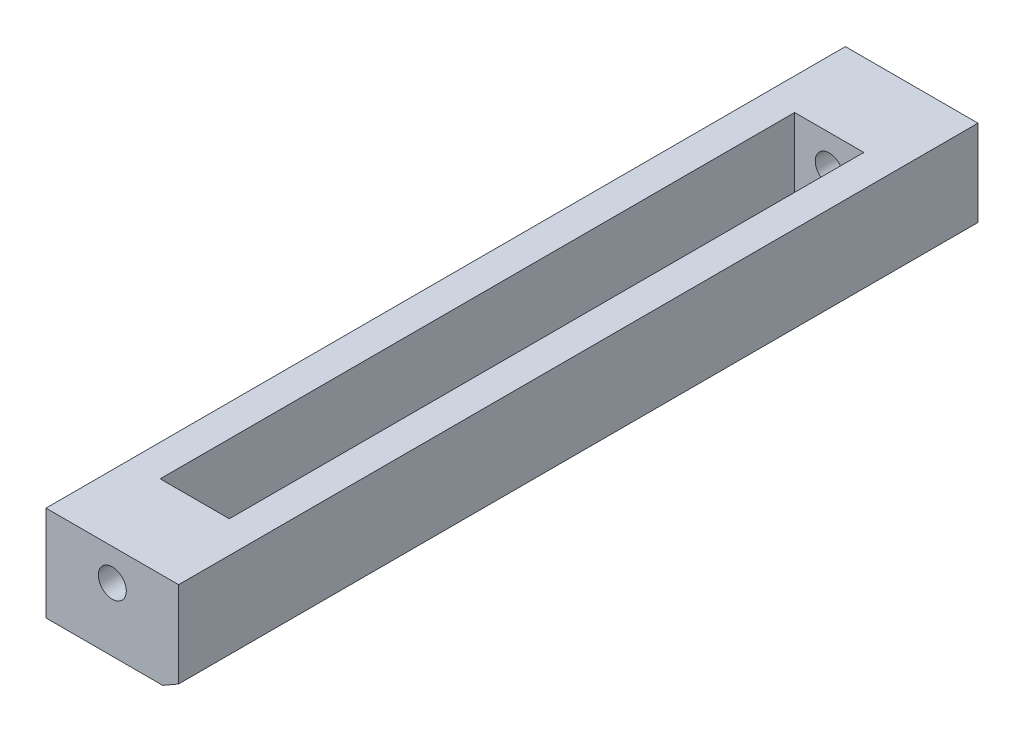
ISO-10303-21;
HEADER;
FILE_DESCRIPTION(('STEP AP214'),'2;1');
FILE_NAME('part.step','',(''),(''),'','','');
FILE_SCHEMA(('AUTOMOTIVE_DESIGN { 1 0 10303 214 1 1 1 1 }'));
ENDSEC;
DATA;
#1=APPLICATION_CONTEXT('core data for automotive mechanical design processes');
#2=APPLICATION_PROTOCOL_DEFINITION('international standard','automotive_design',2000,#1);
#3=PRODUCT_CONTEXT('',#1,'mechanical');
#4=PRODUCT('Part','Part','',(#3));
#5=PRODUCT_RELATED_PRODUCT_CATEGORY('part','',(#4));
#6=PRODUCT_DEFINITION_FORMATION('','',#4);
#7=PRODUCT_DEFINITION_CONTEXT('part definition',#1,'design');
#8=PRODUCT_DEFINITION('design','',#6,#7);
#9=PRODUCT_DEFINITION_SHAPE('','',#8);
#10=(LENGTH_UNIT() NAMED_UNIT(*) SI_UNIT(.MILLI.,.METRE.));
#11=(NAMED_UNIT(*) PLANE_ANGLE_UNIT() SI_UNIT($,.RADIAN.));
#12=(NAMED_UNIT(*) SI_UNIT($,.STERADIAN.) SOLID_ANGLE_UNIT());
#13=UNCERTAINTY_MEASURE_WITH_UNIT(LENGTH_MEASURE(1.E-05),#10,'distance_accuracy_value','');
#14=(GEOMETRIC_REPRESENTATION_CONTEXT(3) GLOBAL_UNCERTAINTY_ASSIGNED_CONTEXT((#13)) GLOBAL_UNIT_ASSIGNED_CONTEXT((#10,
#11,#12)) REPRESENTATION_CONTEXT('',''));
#15=CARTESIAN_POINT('',(0.,0.,0.));
#16=DIRECTION('',(0.,0.,1.));
#17=DIRECTION('',(1.,0.,0.));
#18=AXIS2_PLACEMENT_3D('',#15,#16,#17);
#19=CARTESIAN_POINT('',(6.63575,-6.35,40.00000001));
#20=DIRECTION('',(1.,0.,0.));
#21=DIRECTION('',(0.,0.,-1.));
#22=AXIS2_PLACEMENT_3D('',#19,#20,#21);
#23=PLANE('',#22);
#24=DIRECTION('',(0.,1.,0.));
#25=VECTOR('',#24,1.);
#26=CARTESIAN_POINT('',(6.63575,-6.35,40.00000001));
#27=LINE('',#26,#25);
#28=CARTESIAN_POINT('',(6.63575,-5.43345644766147,40.00000001));
#29=VERTEX_POINT('',#28);
#30=CARTESIAN_POINT('',(6.63575,3.175,40.00000001));
#31=VERTEX_POINT('',#30);
#32=EDGE_CURVE('E174',#29,#31,#27,.T.);
#33=ORIENTED_EDGE('',*,*,#32,.F.);
#34=DIRECTION('',(0.,0.,-1.));
#35=VECTOR('',#34,1.);
#36=CARTESIAN_POINT('',(6.63575,-5.43345644766147,40.00000001));
#37=LINE('',#36,#35);
#38=CARTESIAN_POINT('',(6.63575,-5.43345644766147,-40.00000001));
#39=VERTEX_POINT('',#38);
#40=EDGE_CURVE('E176',#29,#39,#37,.T.);
#41=ORIENTED_EDGE('',*,*,#40,.T.);
#42=DIRECTION('',(0.,1.,0.));
#43=VECTOR('',#42,1.);
#44=CARTESIAN_POINT('',(6.63575,-6.35,-40.00000001));
#45=LINE('',#44,#43);
#46=CARTESIAN_POINT('',(6.63575,3.175,-40.00000001));
#47=VERTEX_POINT('',#46);
#48=EDGE_CURVE('E173',#39,#47,#45,.T.);
#49=ORIENTED_EDGE('',*,*,#48,.T.);
#50=DIRECTION('',(0.,0.,-1.));
#51=VECTOR('',#50,1.);
#52=CARTESIAN_POINT('',(6.63575,3.175,40.00000001));
#53=LINE('',#52,#51);
#54=EDGE_CURVE('E142',#31,#47,#53,.T.);
#55=ORIENTED_EDGE('',*,*,#54,.F.);
#56=EDGE_LOOP('',(#33,#41,#49,#55));
#57=FACE_BOUND('',#56,.T.);
#58=ADVANCED_FACE('F38',(#57),#23,.T.);
#59=CARTESIAN_POINT('',(-6.63575,-6.35,40.00000001));
#60=DIRECTION('',(0.,0.,1.));
#61=DIRECTION('',(1.,0.,0.));
#62=AXIS2_PLACEMENT_3D('',#59,#60,#61);
#63=PLANE('',#62);
#64=CARTESIAN_POINT('',(0.,0.,40.00000001));
#65=DIRECTION('',(0.,0.,1.));
#66=DIRECTION('',(1.,0.,0.));
#67=AXIS2_PLACEMENT_3D('',#64,#65,#66);
#68=CIRCLE('',#67,1.399999994);
#69=CARTESIAN_POINT('',(1.399999994,0.,40.00000001));
#70=VERTEX_POINT('',#69);
#71=EDGE_CURVE('E252',#70,#70,#68,.T.);
#72=ORIENTED_EDGE('',*,*,#71,.F.);
#73=EDGE_LOOP('',(#72));
#74=FACE_BOUND('',#73,.T.);
#75=DIRECTION('',(1.,0.,0.));
#76=VECTOR('',#75,1.);
#77=CARTESIAN_POINT('',(-6.63575,-6.35,40.00000001));
#78=LINE('',#77,#76);
#79=CARTESIAN_POINT('',(-6.63575,-6.35,40.00000001));
#80=VERTEX_POINT('',#79);
#81=CARTESIAN_POINT('',(5.04825,-6.35,40.00000001));
#82=VERTEX_POINT('',#81);
#83=EDGE_CURVE('E171',#80,#82,#78,.T.);
#84=ORIENTED_EDGE('',*,*,#83,.T.);
#85=DIRECTION('',(-0.86602540378444,-0.499999999999998,0.));
#86=VECTOR('',#85,1.);
#87=CARTESIAN_POINT('',(-3.71475000000003,-11.4093204089087,40.00000001));
#88=LINE('',#87,#86);
#89=EDGE_CURVE('E11',#82,#29,#88,.F.);
#90=ORIENTED_EDGE('',*,*,#89,.T.);
#91=ORIENTED_EDGE('',*,*,#32,.T.);
#92=DIRECTION('',(1.,0.,0.));
#93=VECTOR('',#92,1.);
#94=CARTESIAN_POINT('',(-6.63575,3.175,40.00000001));
#95=LINE('',#94,#93);
#96=CARTESIAN_POINT('',(-6.63575,3.175,40.00000001));
#97=VERTEX_POINT('',#96);
#98=EDGE_CURVE('E151',#97,#31,#95,.T.);
#99=ORIENTED_EDGE('',*,*,#98,.F.);
#100=DIRECTION('',(0.,1.,0.));
#101=VECTOR('',#100,1.);
#102=CARTESIAN_POINT('',(-6.63575,-6.35,40.00000001));
#103=LINE('',#102,#101);
#104=EDGE_CURVE('E177',#80,#97,#103,.T.);
#105=ORIENTED_EDGE('',*,*,#104,.F.);
#106=EDGE_LOOP('',(#84,#90,#91,#99,#105));
#107=FACE_BOUND('',#106,.T.);
#108=ADVANCED_FACE('F201',(#74,#107),#63,.T.);
#109=CARTESIAN_POINT('',(-6.63575,-6.35,40.00000001));
#110=DIRECTION('',(-1.,0.,0.));
#111=DIRECTION('',(0.,0.,1.));
#112=AXIS2_PLACEMENT_3D('',#109,#110,#111);
#113=PLANE('',#112);
#114=ORIENTED_EDGE('',*,*,#104,.T.);
#115=DIRECTION('',(0.,0.,1.));
#116=VECTOR('',#115,1.);
#117=CARTESIAN_POINT('',(-6.63575,3.175,40.00000001));
#118=LINE('',#117,#116);
#119=CARTESIAN_POINT('',(-6.63575,3.175,-40.00000001));
#120=VERTEX_POINT('',#119);
#121=EDGE_CURVE('E148',#120,#97,#118,.T.);
#122=ORIENTED_EDGE('',*,*,#121,.F.);
#123=DIRECTION('',(0.,1.,0.));
#124=VECTOR('',#123,1.);
#125=CARTESIAN_POINT('',(-6.63575,-6.35,-40.00000001));
#126=LINE('',#125,#124);
#127=CARTESIAN_POINT('',(-6.63575,-6.35,-40.00000001));
#128=VERTEX_POINT('',#127);
#129=EDGE_CURVE('E179',#128,#120,#126,.T.);
#130=ORIENTED_EDGE('',*,*,#129,.F.);
#131=DIRECTION('',(0.,0.,1.));
#132=VECTOR('',#131,1.);
#133=CARTESIAN_POINT('',(-6.63575,-6.35,40.00000001));
#134=LINE('',#133,#132);
#135=EDGE_CURVE('E168',#128,#80,#134,.T.);
#136=ORIENTED_EDGE('',*,*,#135,.T.);
#137=EDGE_LOOP('',(#114,#122,#130,#136));
#138=FACE_BOUND('',#137,.T.);
#139=ADVANCED_FACE('F214',(#138),#113,.T.);
#140=CARTESIAN_POINT('',(-6.63575,-6.35,-40.00000001));
#141=DIRECTION('',(0.,0.,-1.));
#142=DIRECTION('',(-1.,0.,0.));
#143=AXIS2_PLACEMENT_3D('',#140,#141,#142);
#144=PLANE('',#143);
#145=CARTESIAN_POINT('',(0.,0.,-40.00000001));
#146=DIRECTION('',(0.,0.,1.));
#147=DIRECTION('',(1.,0.,0.));
#148=AXIS2_PLACEMENT_3D('',#145,#146,#147);
#149=CIRCLE('',#148,1.399999994);
#150=CARTESIAN_POINT('',(1.399999994,0.,-40.00000001));
#151=VERTEX_POINT('',#150);
#152=EDGE_CURVE('E185',#151,#151,#149,.T.);
#153=ORIENTED_EDGE('',*,*,#152,.T.);
#154=EDGE_LOOP('',(#153));
#155=FACE_BOUND('',#154,.T.);
#156=ORIENTED_EDGE('',*,*,#48,.F.);
#157=DIRECTION('',(0.86602540378444,0.499999999999998,0.));
#158=VECTOR('',#157,1.);
#159=CARTESIAN_POINT('',(-3.71475000000003,-11.4093204089087,-40.00000001));
#160=LINE('',#159,#158);
#161=CARTESIAN_POINT('',(5.04825,-6.35,-40.00000001));
#162=VERTEX_POINT('',#161);
#163=EDGE_CURVE('E61',#39,#162,#160,.F.);
#164=ORIENTED_EDGE('',*,*,#163,.T.);
#165=DIRECTION('',(-1.,0.,0.));
#166=VECTOR('',#165,1.);
#167=CARTESIAN_POINT('',(-6.63575,-6.35,-40.00000001));
#168=LINE('',#167,#166);
#169=EDGE_CURVE('E163',#162,#128,#168,.T.);
#170=ORIENTED_EDGE('',*,*,#169,.T.);
#171=ORIENTED_EDGE('',*,*,#129,.T.);
#172=DIRECTION('',(-1.,0.,0.));
#173=VECTOR('',#172,1.);
#174=CARTESIAN_POINT('',(-6.63575,3.175,-40.00000001));
#175=LINE('',#174,#173);
#176=EDGE_CURVE('E145',#47,#120,#175,.T.);
#177=ORIENTED_EDGE('',*,*,#176,.F.);
#178=EDGE_LOOP('',(#156,#164,#170,#171,#177));
#179=FACE_BOUND('',#178,.T.);
#180=ADVANCED_FACE('F195',(#155,#179),#144,.T.);
#181=CARTESIAN_POINT('',(0.,-6.35,0.));
#182=DIRECTION('',(0.,-1.,0.));
#183=DIRECTION('',(0.,0.,-1.));
#184=AXIS2_PLACEMENT_3D('',#181,#182,#183);
#185=PLANE('',#184);
#186=DIRECTION('',(0.,0.,-1.));
#187=VECTOR('',#186,1.);
#188=CARTESIAN_POINT('',(3.46075,-6.35,31.75));
#189=LINE('',#188,#187);
#190=CARTESIAN_POINT('',(3.46075,-6.35,31.75));
#191=VERTEX_POINT('',#190);
#192=CARTESIAN_POINT('',(3.46075,-6.35,-31.75));
#193=VERTEX_POINT('',#192);
#194=EDGE_CURVE('E154',#191,#193,#189,.T.);
#195=ORIENTED_EDGE('',*,*,#194,.T.);
#196=DIRECTION('',(-1.,0.,0.));
#197=VECTOR('',#196,1.);
#198=CARTESIAN_POINT('',(-3.46075,-6.35,-31.75));
#199=LINE('',#198,#197);
#200=CARTESIAN_POINT('',(-3.46075,-6.35,-31.75));
#201=VERTEX_POINT('',#200);
#202=EDGE_CURVE('E117',#193,#201,#199,.T.);
#203=ORIENTED_EDGE('',*,*,#202,.T.);
#204=DIRECTION('',(0.,0.,1.));
#205=VECTOR('',#204,1.);
#206=CARTESIAN_POINT('',(-3.46075,-6.35,31.75));
#207=LINE('',#206,#205);
#208=CARTESIAN_POINT('',(-3.46075,-6.35,31.75));
#209=VERTEX_POINT('',#208);
#210=EDGE_CURVE('E157',#201,#209,#207,.T.);
#211=ORIENTED_EDGE('',*,*,#210,.T.);
#212=DIRECTION('',(1.,0.,0.));
#213=VECTOR('',#212,1.);
#214=CARTESIAN_POINT('',(-3.46075,-6.35,31.75));
#215=LINE('',#214,#213);
#216=EDGE_CURVE('E122',#209,#191,#215,.T.);
#217=ORIENTED_EDGE('',*,*,#216,.T.);
#218=EDGE_LOOP('',(#195,#203,#211,#217));
#219=FACE_BOUND('',#218,.T.);
#220=ORIENTED_EDGE('',*,*,#169,.F.);
#221=DIRECTION('',(0.,0.,1.));
#222=VECTOR('',#221,1.);
#223=CARTESIAN_POINT('',(5.04825,-6.35,0.));
#224=LINE('',#223,#222);
#225=EDGE_CURVE('E47',#162,#82,#224,.T.);
#226=ORIENTED_EDGE('',*,*,#225,.T.);
#227=ORIENTED_EDGE('',*,*,#83,.F.);
#228=ORIENTED_EDGE('',*,*,#135,.F.);
#229=EDGE_LOOP('',(#220,#226,#227,#228));
#230=FACE_BOUND('',#229,.T.);
#231=ADVANCED_FACE('F220',(#219,#230),#185,.T.);
#232=CARTESIAN_POINT('',(3.46075,-6.35,31.75));
#233=DIRECTION('',(1.,0.,0.));
#234=DIRECTION('',(0.,0.,-1.));
#235=AXIS2_PLACEMENT_3D('',#232,#233,#234);
#236=PLANE('',#235);
#237=DIRECTION('',(0.,1.,0.));
#238=VECTOR('',#237,1.);
#239=CARTESIAN_POINT('',(3.46075,-6.35,31.75));
#240=LINE('',#239,#238);
#241=CARTESIAN_POINT('',(3.46075,3.175,31.75));
#242=VERTEX_POINT('',#241);
#243=EDGE_CURVE('E127',#191,#242,#240,.T.);
#244=ORIENTED_EDGE('',*,*,#243,.T.);
#245=DIRECTION('',(0.,0.,-1.));
#246=VECTOR('',#245,1.);
#247=CARTESIAN_POINT('',(3.46075,3.175,31.75));
#248=LINE('',#247,#246);
#249=CARTESIAN_POINT('',(3.46075,3.175,-31.75));
#250=VERTEX_POINT('',#249);
#251=EDGE_CURVE('E125',#242,#250,#248,.T.);
#252=ORIENTED_EDGE('',*,*,#251,.T.);
#253=DIRECTION('',(0.,1.,0.));
#254=VECTOR('',#253,1.);
#255=CARTESIAN_POINT('',(3.46075,-6.35,-31.75));
#256=LINE('',#255,#254);
#257=EDGE_CURVE('E109',#193,#250,#256,.T.);
#258=ORIENTED_EDGE('',*,*,#257,.F.);
#259=ORIENTED_EDGE('',*,*,#194,.F.);
#260=EDGE_LOOP('',(#244,#252,#258,#259));
#261=FACE_BOUND('',#260,.T.);
#262=ADVANCED_FACE('F126',(#261),#236,.F.);
#263=CARTESIAN_POINT('',(-3.46075,-6.35,31.75));
#264=DIRECTION('',(0.,0.,1.));
#265=DIRECTION('',(1.,0.,0.));
#266=AXIS2_PLACEMENT_3D('',#263,#264,#265);
#267=PLANE('',#266);
#268=CARTESIAN_POINT('',(0.,0.,31.75));
#269=DIRECTION('',(0.,0.,1.));
#270=DIRECTION('',(1.,0.,0.));
#271=AXIS2_PLACEMENT_3D('',#268,#269,#270);
#272=CIRCLE('',#271,1.399999994);
#273=CARTESIAN_POINT('',(1.399999994,0.,31.75));
#274=VERTEX_POINT('',#273);
#275=EDGE_CURVE('E131',#274,#274,#272,.T.);
#276=ORIENTED_EDGE('',*,*,#275,.T.);
#277=EDGE_LOOP('',(#276));
#278=FACE_BOUND('',#277,.T.);
#279=DIRECTION('',(0.,1.,0.));
#280=VECTOR('',#279,1.);
#281=CARTESIAN_POINT('',(-3.46075,-6.35,31.75));
#282=LINE('',#281,#280);
#283=CARTESIAN_POINT('',(-3.46075,3.175,31.75));
#284=VERTEX_POINT('',#283);
#285=EDGE_CURVE('E164',#209,#284,#282,.T.);
#286=ORIENTED_EDGE('',*,*,#285,.T.);
#287=DIRECTION('',(1.,0.,0.));
#288=VECTOR('',#287,1.);
#289=CARTESIAN_POINT('',(-3.46075,3.175,31.75));
#290=LINE('',#289,#288);
#291=EDGE_CURVE('E137',#284,#242,#290,.T.);
#292=ORIENTED_EDGE('',*,*,#291,.T.);
#293=ORIENTED_EDGE('',*,*,#243,.F.);
#294=ORIENTED_EDGE('',*,*,#216,.F.);
#295=EDGE_LOOP('',(#286,#292,#293,#294));
#296=FACE_BOUND('',#295,.T.);
#297=ADVANCED_FACE('F230',(#278,#296),#267,.F.);
#298=CARTESIAN_POINT('',(-3.46075,-6.35,31.75));
#299=DIRECTION('',(-1.,0.,0.));
#300=DIRECTION('',(0.,0.,1.));
#301=AXIS2_PLACEMENT_3D('',#298,#299,#300);
#302=PLANE('',#301);
#303=DIRECTION('',(0.,1.,0.));
#304=VECTOR('',#303,1.);
#305=CARTESIAN_POINT('',(-3.46075,-6.35,-31.75));
#306=LINE('',#305,#304);
#307=CARTESIAN_POINT('',(-3.46075,3.175,-31.75));
#308=VERTEX_POINT('',#307);
#309=EDGE_CURVE('E121',#201,#308,#306,.T.);
#310=ORIENTED_EDGE('',*,*,#309,.T.);
#311=DIRECTION('',(0.,0.,1.));
#312=VECTOR('',#311,1.);
#313=CARTESIAN_POINT('',(-3.46075,3.175,31.75));
#314=LINE('',#313,#312);
#315=EDGE_CURVE('E135',#308,#284,#314,.T.);
#316=ORIENTED_EDGE('',*,*,#315,.T.);
#317=ORIENTED_EDGE('',*,*,#285,.F.);
#318=ORIENTED_EDGE('',*,*,#210,.F.);
#319=EDGE_LOOP('',(#310,#316,#317,#318));
#320=FACE_BOUND('',#319,.T.);
#321=ADVANCED_FACE('F233',(#320),#302,.F.);
#322=CARTESIAN_POINT('',(-3.46075,-6.35,-31.75));
#323=DIRECTION('',(0.,0.,-1.));
#324=DIRECTION('',(-1.,0.,0.));
#325=AXIS2_PLACEMENT_3D('',#322,#323,#324);
#326=PLANE('',#325);
#327=CARTESIAN_POINT('',(0.,0.,-31.75));
#328=DIRECTION('',(0.,0.,-1.));
#329=DIRECTION('',(-1.,0.,0.));
#330=AXIS2_PLACEMENT_3D('',#327,#328,#329);
#331=CIRCLE('',#330,1.399999994);
#332=CARTESIAN_POINT('',(-1.399999994,0.,-31.75));
#333=VERTEX_POINT('',#332);
#334=EDGE_CURVE('E182',#333,#333,#331,.T.);
#335=ORIENTED_EDGE('',*,*,#334,.T.);
#336=EDGE_LOOP('',(#335));
#337=FACE_BOUND('',#336,.T.);
#338=ORIENTED_EDGE('',*,*,#257,.T.);
#339=DIRECTION('',(-1.,0.,0.));
#340=VECTOR('',#339,1.);
#341=CARTESIAN_POINT('',(-3.46075,3.175,-31.75));
#342=LINE('',#341,#340);
#343=EDGE_CURVE('E114',#250,#308,#342,.T.);
#344=ORIENTED_EDGE('',*,*,#343,.T.);
#345=ORIENTED_EDGE('',*,*,#309,.F.);
#346=ORIENTED_EDGE('',*,*,#202,.F.);
#347=EDGE_LOOP('',(#338,#344,#345,#346));
#348=FACE_BOUND('',#347,.T.);
#349=ADVANCED_FACE('F111',(#337,#348),#326,.F.);
#350=CARTESIAN_POINT('',(0.,3.175,0.));
#351=DIRECTION('',(0.,-1.,0.));
#352=DIRECTION('',(0.,0.,-1.));
#353=AXIS2_PLACEMENT_3D('',#350,#351,#352);
#354=PLANE('',#353);
#355=ORIENTED_EDGE('',*,*,#54,.T.);
#356=ORIENTED_EDGE('',*,*,#176,.T.);
#357=ORIENTED_EDGE('',*,*,#121,.T.);
#358=ORIENTED_EDGE('',*,*,#98,.T.);
#359=EDGE_LOOP('',(#355,#356,#357,#358));
#360=FACE_BOUND('',#359,.T.);
#361=ORIENTED_EDGE('',*,*,#251,.F.);
#362=ORIENTED_EDGE('',*,*,#291,.F.);
#363=ORIENTED_EDGE('',*,*,#315,.F.);
#364=ORIENTED_EDGE('',*,*,#343,.F.);
#365=EDGE_LOOP('',(#361,#362,#363,#364));
#366=FACE_BOUND('',#365,.T.);
#367=ADVANCED_FACE('F133',(#360,#366),#354,.F.);
#368=CARTESIAN_POINT('',(0.,0.,-40.00000001));
#369=DIRECTION('',(0.,0.,1.));
#370=DIRECTION('',(1.,0.,0.));
#371=AXIS2_PLACEMENT_3D('',#368,#369,#370);
#372=CYLINDRICAL_SURFACE('',#371,1.399999994);
#373=ORIENTED_EDGE('',*,*,#152,.F.);
#374=EDGE_LOOP('',(#373));
#375=FACE_BOUND('',#374,.T.);
#376=ORIENTED_EDGE('',*,*,#334,.F.);
#377=EDGE_LOOP('',(#376));
#378=FACE_BOUND('',#377,.T.);
#379=ADVANCED_FACE('F207',(#375,#378),#372,.F.);
#380=ORIENTED_EDGE('',*,*,#71,.T.);
#381=EDGE_LOOP('',(#380));
#382=FACE_BOUND('',#381,.T.);
#383=ORIENTED_EDGE('',*,*,#275,.F.);
#384=EDGE_LOOP('',(#383));
#385=FACE_BOUND('',#384,.T.);
#386=ADVANCED_FACE('F203',(#382,#385),#372,.F.);
#387=CARTESIAN_POINT('',(6.63575,-5.43345644766147,40.00000001));
#388=DIRECTION('',(-0.499999999999997,0.86602540378444,0.));
#389=DIRECTION('',(0.,0.,-1.));
#390=AXIS2_PLACEMENT_3D('',#387,#388,#389);
#391=PLANE('',#390);
#392=ORIENTED_EDGE('',*,*,#89,.F.);
#393=ORIENTED_EDGE('',*,*,#225,.F.);
#394=ORIENTED_EDGE('',*,*,#163,.F.);
#395=ORIENTED_EDGE('',*,*,#40,.F.);
#396=EDGE_LOOP('',(#392,#393,#394,#395));
#397=FACE_BOUND('',#396,.T.);
#398=ADVANCED_FACE('F41',(#397),#391,.F.);
#399=CLOSED_SHELL('',(#58,#108,#139,#180,#231,#262,#297,#321,#349,#367,#379,#386,#398));
#400=MANIFOLD_SOLID_BREP('B2',#399);
#401=ADVANCED_BREP_SHAPE_REPRESENTATION('',(#18,#400),#14);
#402=SHAPE_DEFINITION_REPRESENTATION(#9,#401);
ENDSEC;
END-ISO-10303-21;
